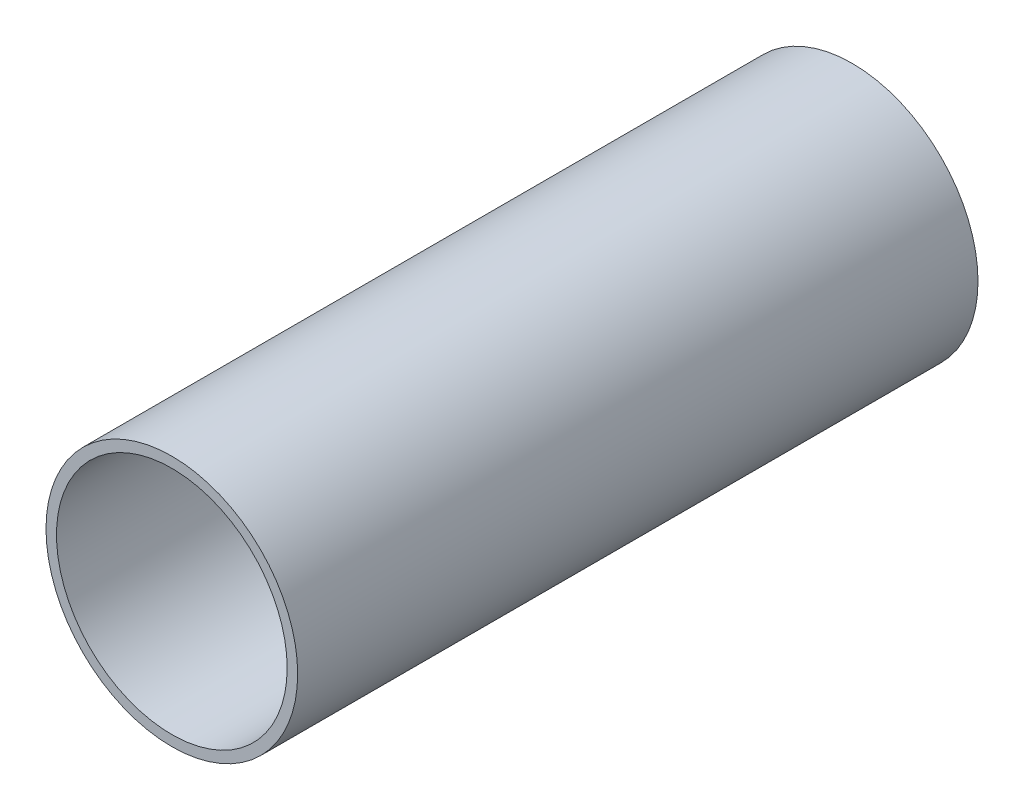
ISO-10303-21;
HEADER;
FILE_DESCRIPTION(('STEP AP214'),'2;1');
FILE_NAME('part.step','',(''),(''),'','','');
FILE_SCHEMA(('AUTOMOTIVE_DESIGN { 1 0 10303 214 1 1 1 1 }'));
ENDSEC;
DATA;
#1=APPLICATION_CONTEXT('core data for automotive mechanical design processes');
#2=APPLICATION_PROTOCOL_DEFINITION('international standard','automotive_design',2000,#1);
#3=PRODUCT_CONTEXT('',#1,'mechanical');
#4=PRODUCT('Part','Part','',(#3));
#5=PRODUCT_RELATED_PRODUCT_CATEGORY('part','',(#4));
#6=PRODUCT_DEFINITION_FORMATION('','',#4);
#7=PRODUCT_DEFINITION_CONTEXT('part definition',#1,'design');
#8=PRODUCT_DEFINITION('design','',#6,#7);
#9=PRODUCT_DEFINITION_SHAPE('','',#8);
#10=(LENGTH_UNIT() NAMED_UNIT(*) SI_UNIT(.MILLI.,.METRE.));
#11=(NAMED_UNIT(*) PLANE_ANGLE_UNIT() SI_UNIT($,.RADIAN.));
#12=(NAMED_UNIT(*) SI_UNIT($,.STERADIAN.) SOLID_ANGLE_UNIT());
#13=UNCERTAINTY_MEASURE_WITH_UNIT(LENGTH_MEASURE(1.E-05),#10,'distance_accuracy_value','');
#14=(GEOMETRIC_REPRESENTATION_CONTEXT(3) GLOBAL_UNCERTAINTY_ASSIGNED_CONTEXT((#13)) GLOBAL_UNIT_ASSIGNED_CONTEXT((#10,
#11,#12)) REPRESENTATION_CONTEXT('',''));
#15=CARTESIAN_POINT('',(0.,0.,0.));
#16=DIRECTION('',(0.,0.,1.));
#17=DIRECTION('',(1.,0.,0.));
#18=AXIS2_PLACEMENT_3D('',#15,#16,#17);
#19=CARTESIAN_POINT('',(0.,0.,412.));
#20=DIRECTION('',(0.,0.,1.));
#21=DIRECTION('',(1.,0.,0.));
#22=AXIS2_PLACEMENT_3D('',#19,#20,#21);
#23=PLANE('',#22);
#24=CARTESIAN_POINT('',(0.,0.,412.));
#25=DIRECTION('',(0.,0.,1.));
#26=DIRECTION('',(1.,0.,0.));
#27=AXIS2_PLACEMENT_3D('',#24,#25,#26);
#28=CIRCLE('',#27,76.2);
#29=CARTESIAN_POINT('',(76.2,0.,412.));
#30=VERTEX_POINT('',#29);
#31=EDGE_CURVE('E10',#30,#30,#28,.T.);
#32=ORIENTED_EDGE('',*,*,#31,.T.);
#33=EDGE_LOOP('',(#32));
#34=FACE_BOUND('',#33,.T.);
#35=CARTESIAN_POINT('',(0.,0.,412.));
#36=DIRECTION('',(0.,0.,1.));
#37=DIRECTION('',(1.,0.,0.));
#38=AXIS2_PLACEMENT_3D('',#35,#36,#37);
#39=CIRCLE('',#38,69.85);
#40=CARTESIAN_POINT('',(69.85,0.,412.));
#41=VERTEX_POINT('',#40);
#42=EDGE_CURVE('E46',#41,#41,#39,.T.);
#43=ORIENTED_EDGE('',*,*,#42,.F.);
#44=EDGE_LOOP('',(#43));
#45=FACE_BOUND('',#44,.T.);
#46=ADVANCED_FACE('F35',(#34,#45),#23,.T.);
#47=CARTESIAN_POINT('',(0.,0.,0.));
#48=DIRECTION('',(0.,0.,1.));
#49=DIRECTION('',(1.,0.,0.));
#50=AXIS2_PLACEMENT_3D('',#47,#48,#49);
#51=PLANE('',#50);
#52=CARTESIAN_POINT('',(0.,0.,0.));
#53=DIRECTION('',(0.,0.,1.));
#54=DIRECTION('',(1.,0.,0.));
#55=AXIS2_PLACEMENT_3D('',#52,#53,#54);
#56=CIRCLE('',#55,76.2);
#57=CARTESIAN_POINT('',(76.2,0.,0.));
#58=VERTEX_POINT('',#57);
#59=EDGE_CURVE('E39',#58,#58,#56,.T.);
#60=ORIENTED_EDGE('',*,*,#59,.F.);
#61=EDGE_LOOP('',(#60));
#62=FACE_BOUND('',#61,.T.);
#63=CARTESIAN_POINT('',(0.,0.,0.));
#64=DIRECTION('',(0.,0.,1.));
#65=DIRECTION('',(1.,0.,0.));
#66=AXIS2_PLACEMENT_3D('',#63,#64,#65);
#67=CIRCLE('',#66,69.85);
#68=CARTESIAN_POINT('',(69.85,0.,0.));
#69=VERTEX_POINT('',#68);
#70=EDGE_CURVE('E48',#69,#69,#67,.T.);
#71=ORIENTED_EDGE('',*,*,#70,.T.);
#72=EDGE_LOOP('',(#71));
#73=FACE_BOUND('',#72,.T.);
#74=ADVANCED_FACE('F58',(#62,#73),#51,.F.);
#75=CARTESIAN_POINT('',(0.,0.,412.));
#76=DIRECTION('',(0.,0.,-1.));
#77=DIRECTION('',(-1.,0.,0.));
#78=AXIS2_PLACEMENT_3D('',#75,#76,#77);
#79=CYLINDRICAL_SURFACE('',#78,76.2);
#80=ORIENTED_EDGE('',*,*,#31,.F.);
#81=EDGE_LOOP('',(#80));
#82=FACE_BOUND('',#81,.T.);
#83=ORIENTED_EDGE('',*,*,#59,.T.);
#84=EDGE_LOOP('',(#83));
#85=FACE_BOUND('',#84,.T.);
#86=ADVANCED_FACE('F37',(#82,#85),#79,.T.);
#87=CARTESIAN_POINT('',(0.,0.,412.));
#88=DIRECTION('',(0.,0.,-1.));
#89=DIRECTION('',(-1.,0.,0.));
#90=AXIS2_PLACEMENT_3D('',#87,#88,#89);
#91=CYLINDRICAL_SURFACE('',#90,69.85);
#92=ORIENTED_EDGE('',*,*,#42,.T.);
#93=EDGE_LOOP('',(#92));
#94=FACE_BOUND('',#93,.T.);
#95=ORIENTED_EDGE('',*,*,#70,.F.);
#96=EDGE_LOOP('',(#95));
#97=FACE_BOUND('',#96,.T.);
#98=ADVANCED_FACE('F54',(#94,#97),#91,.F.);
#99=CLOSED_SHELL('',(#46,#74,#86,#98));
#100=MANIFOLD_SOLID_BREP('B2',#99);
#101=ADVANCED_BREP_SHAPE_REPRESENTATION('',(#18,#100),#14);
#102=SHAPE_DEFINITION_REPRESENTATION(#9,#101);
ENDSEC;
END-ISO-10303-21;
